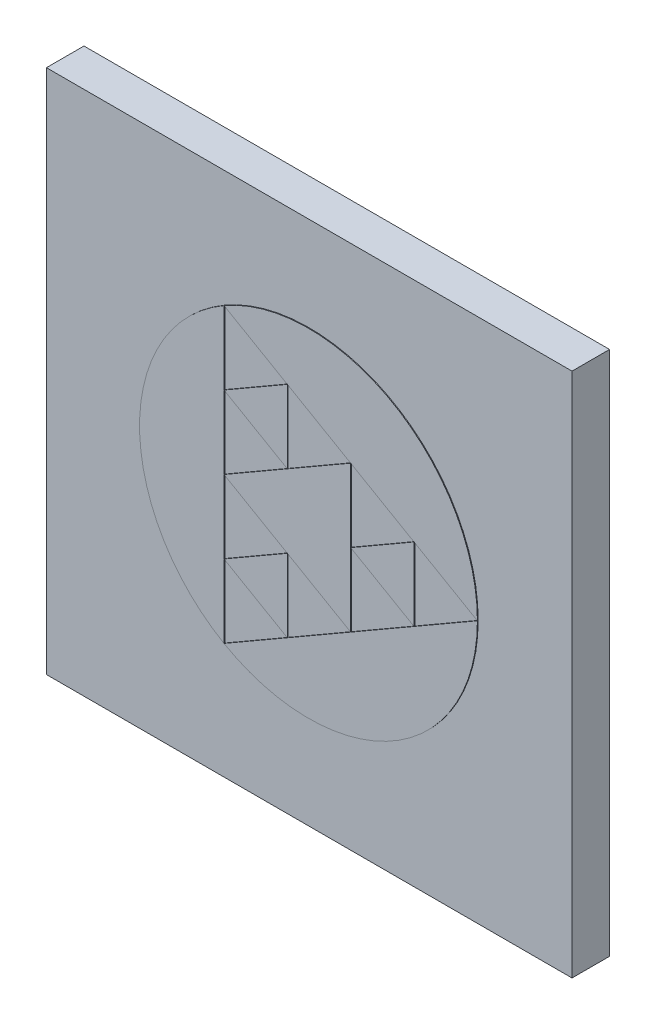
ISO-10303-21;
HEADER;
FILE_DESCRIPTION(('STEP AP214'),'2;1');
FILE_NAME('part.step','',(''),(''),'','','');
FILE_SCHEMA(('AUTOMOTIVE_DESIGN { 1 0 10303 214 1 1 1 1 }'));
ENDSEC;
DATA;
#1=APPLICATION_CONTEXT('core data for automotive mechanical design processes');
#2=APPLICATION_PROTOCOL_DEFINITION('international standard','automotive_design',2000,#1);
#3=PRODUCT_CONTEXT('',#1,'mechanical');
#4=PRODUCT('Part','Part','',(#3));
#5=PRODUCT_RELATED_PRODUCT_CATEGORY('part','',(#4));
#6=PRODUCT_DEFINITION_FORMATION('','',#4);
#7=PRODUCT_DEFINITION_CONTEXT('part definition',#1,'design');
#8=PRODUCT_DEFINITION('design','',#6,#7);
#9=PRODUCT_DEFINITION_SHAPE('','',#8);
#10=(LENGTH_UNIT() NAMED_UNIT(*) SI_UNIT(.MILLI.,.METRE.));
#11=(NAMED_UNIT(*) PLANE_ANGLE_UNIT() SI_UNIT($,.RADIAN.));
#12=(NAMED_UNIT(*) SI_UNIT($,.STERADIAN.) SOLID_ANGLE_UNIT());
#13=UNCERTAINTY_MEASURE_WITH_UNIT(LENGTH_MEASURE(1.E-05),#10,'distance_accuracy_value','');
#14=(GEOMETRIC_REPRESENTATION_CONTEXT(3) GLOBAL_UNCERTAINTY_ASSIGNED_CONTEXT((#13)) GLOBAL_UNIT_ASSIGNED_CONTEXT((#10,
#11,#12)) REPRESENTATION_CONTEXT('',''));
#15=CARTESIAN_POINT('',(0.,0.,0.));
#16=DIRECTION('',(0.,0.,1.));
#17=DIRECTION('',(1.,0.,0.));
#18=AXIS2_PLACEMENT_3D('',#15,#16,#17);
#19=CARTESIAN_POINT('',(0.,-7.84142135623731,0.5));
#20=DIRECTION('',(0.,0.,1.));
#21=DIRECTION('',(1.,0.,0.));
#22=AXIS2_PLACEMENT_3D('',#19,#20,#21);
#23=PLANE('',#22);
#24=DIRECTION('',(0.866025403784439,0.5,0.));
#25=VECTOR('',#24,1.);
#26=CARTESIAN_POINT('',(-3.25481004813967,-2.2039249838737,0.5));
#27=LINE('',#26,#25);
#28=CARTESIAN_POINT('',(0.562500000000003,0.,0.5));
#29=VERTEX_POINT('',#28);
#30=CARTESIAN_POINT('',(1.40625,0.487139289628746,0.5));
#31=VERTEX_POINT('',#30);
#32=EDGE_CURVE('P0_E59',#29,#31,#27,.T.);
#33=ORIENTED_EDGE('',*,*,#32,.T.);
#34=DIRECTION('',(0.,-1.,0.));
#35=VECTOR('',#34,1.);
#36=CARTESIAN_POINT('',(1.40625,-7.84142135623731,0.5));
#37=LINE('',#36,#35);
#38=CARTESIAN_POINT('',(1.40625,-0.487139289628749,0.5));
#39=VERTEX_POINT('',#38);
#40=EDGE_CURVE('P0_E48',#31,#39,#37,.T.);
#41=ORIENTED_EDGE('',*,*,#40,.T.);
#42=DIRECTION('',(-0.866025403784439,0.5,0.));
#43=VECTOR('',#42,1.);
#44=CARTESIAN_POINT('',(3.53606004813967,-1.71678569424496,0.5));
#45=LINE('',#44,#43);
#46=EDGE_CURVE('P0_E20',#39,#29,#45,.T.);
#47=ORIENTED_EDGE('',*,*,#46,.T.);
#48=EDGE_LOOP('',(#33,#41,#47));
#49=FACE_BOUND('',#48,.T.);
#50=ADVANCED_FACE('P0_F17',(#49),#23,.F.);
#51=CARTESIAN_POINT('',(3.53606004813967,-1.71678569424496,0.51));
#52=DIRECTION('',(0.5,0.866025403784439,0.));
#53=DIRECTION('',(-0.866025403784439,0.5,0.));
#54=AXIS2_PLACEMENT_3D('',#51,#52,#53);
#55=PLANE('',#54);
#56=DIRECTION('',(0.,0.,1.));
#57=VECTOR('',#56,1.);
#58=CARTESIAN_POINT('',(1.40625,-0.487139289628749,0.51));
#59=LINE('',#58,#57);
#60=CARTESIAN_POINT('',(1.40625,-0.487139289628749,0.51));
#61=VERTEX_POINT('',#60);
#62=EDGE_CURVE('P0_E54',#39,#61,#59,.T.);
#63=ORIENTED_EDGE('',*,*,#62,.T.);
#64=DIRECTION('',(0.866025403784434,-0.500000000000008,0.));
#65=VECTOR('',#64,1.);
#66=CARTESIAN_POINT('',(0.562500000000004,0.,0.51));
#67=LINE('',#66,#65);
#68=CARTESIAN_POINT('',(0.562500000000003,0.,0.51));
#69=VERTEX_POINT('',#68);
#70=EDGE_CURVE('P0_E68',#69,#61,#67,.T.);
#71=ORIENTED_EDGE('',*,*,#70,.F.);
#72=DIRECTION('',(0.,0.,1.));
#73=VECTOR('',#72,1.);
#74=CARTESIAN_POINT('',(0.562500000000005,0.,0.51));
#75=LINE('',#74,#73);
#76=EDGE_CURVE('P0_E56',#69,#29,#75,.F.);
#77=ORIENTED_EDGE('',*,*,#76,.T.);
#78=ORIENTED_EDGE('',*,*,#46,.F.);
#79=EDGE_LOOP('',(#63,#71,#77,#78));
#80=FACE_BOUND('',#79,.T.);
#81=ADVANCED_FACE('P0_F53',(#80),#55,.F.);
#82=CARTESIAN_POINT('',(1.40625,-7.84142135623731,0.51));
#83=DIRECTION('',(-1.,0.,0.));
#84=DIRECTION('',(0.,-1.,0.));
#85=AXIS2_PLACEMENT_3D('',#82,#83,#84);
#86=PLANE('',#85);
#87=DIRECTION('',(0.,0.,1.));
#88=VECTOR('',#87,1.);
#89=CARTESIAN_POINT('',(1.40625,0.487139289628747,0.51));
#90=LINE('',#89,#88);
#91=CARTESIAN_POINT('',(1.40625,0.487139289628747,0.51));
#92=VERTEX_POINT('',#91);
#93=EDGE_CURVE('P0_E35',#31,#92,#90,.T.);
#94=ORIENTED_EDGE('',*,*,#93,.T.);
#95=DIRECTION('',(0.,1.,0.));
#96=VECTOR('',#95,1.);
#97=CARTESIAN_POINT('',(1.40625,-7.84142135623731,0.51));
#98=LINE('',#97,#96);
#99=EDGE_CURVE('P0_E26',#61,#92,#98,.T.);
#100=ORIENTED_EDGE('',*,*,#99,.F.);
#101=ORIENTED_EDGE('',*,*,#62,.F.);
#102=ORIENTED_EDGE('',*,*,#40,.F.);
#103=EDGE_LOOP('',(#94,#100,#101,#102));
#104=FACE_BOUND('',#103,.T.);
#105=ADVANCED_FACE('P0_F61',(#104),#86,.F.);
#106=CARTESIAN_POINT('',(-3.25481004813967,-2.2039249838737,0.51));
#107=DIRECTION('',(0.5,-0.866025403784439,0.));
#108=DIRECTION('',(0.866025403784439,0.5,0.));
#109=AXIS2_PLACEMENT_3D('',#106,#107,#108);
#110=PLANE('',#109);
#111=ORIENTED_EDGE('',*,*,#76,.F.);
#112=DIRECTION('',(-0.866025403784439,-0.5,0.));
#113=VECTOR('',#112,1.);
#114=CARTESIAN_POINT('',(1.40625,0.487139289628746,0.51));
#115=LINE('',#114,#113);
#116=EDGE_CURVE('P0_E11',#92,#69,#115,.T.);
#117=ORIENTED_EDGE('',*,*,#116,.F.);
#118=ORIENTED_EDGE('',*,*,#93,.F.);
#119=ORIENTED_EDGE('',*,*,#32,.F.);
#120=EDGE_LOOP('',(#111,#117,#118,#119));
#121=FACE_BOUND('',#120,.T.);
#122=ADVANCED_FACE('P0_F73',(#121),#110,.F.);
#123=CARTESIAN_POINT('',(0.,-7.84142135623731,0.51));
#124=DIRECTION('',(0.,0.,1.));
#125=DIRECTION('',(1.,0.,0.));
#126=AXIS2_PLACEMENT_3D('',#123,#124,#125);
#127=PLANE('',#126);
#128=ORIENTED_EDGE('',*,*,#99,.T.);
#129=ORIENTED_EDGE('',*,*,#116,.T.);
#130=ORIENTED_EDGE('',*,*,#70,.T.);
#131=EDGE_LOOP('',(#128,#129,#130));
#132=FACE_BOUND('',#131,.T.);
#133=ADVANCED_FACE('P0_F71',(#132),#127,.T.);
#134=CLOSED_SHELL('',(#50,#81,#105,#122,#133));
#135=MANIFOLD_SOLID_BREP('P0_B1',#134);
#136=CARTESIAN_POINT('',(-3.5,-3.5,0.));
#137=DIRECTION('',(0.,0.,1.));
#138=DIRECTION('',(1.,0.,0.));
#139=AXIS2_PLACEMENT_3D('',#136,#137,#138);
#140=PLANE('',#139);
#141=DIRECTION('',(1.,0.,0.));
#142=VECTOR('',#141,1.);
#143=CARTESIAN_POINT('',(-3.5,3.5,0.));
#144=LINE('',#143,#142);
#145=CARTESIAN_POINT('',(-3.5,3.5,0.));
#146=VERTEX_POINT('',#145);
#147=CARTESIAN_POINT('',(3.5,3.5,0.));
#148=VERTEX_POINT('',#147);
#149=EDGE_CURVE('P1_E81',#146,#148,#144,.T.);
#150=ORIENTED_EDGE('',*,*,#149,.T.);
#151=DIRECTION('',(0.,-1.,0.));
#152=VECTOR('',#151,1.);
#153=CARTESIAN_POINT('',(3.5,3.5,0.));
#154=LINE('',#153,#152);
#155=CARTESIAN_POINT('',(3.5,-3.5,0.));
#156=VERTEX_POINT('',#155);
#157=EDGE_CURVE('P1_E68',#148,#156,#154,.T.);
#158=ORIENTED_EDGE('',*,*,#157,.T.);
#159=DIRECTION('',(1.,0.,0.));
#160=VECTOR('',#159,1.);
#161=CARTESIAN_POINT('',(-3.5,-3.5,0.));
#162=LINE('',#161,#160);
#163=CARTESIAN_POINT('',(-3.5,-3.5,0.));
#164=VERTEX_POINT('',#163);
#165=EDGE_CURVE('P1_E55',#156,#164,#162,.F.);
#166=ORIENTED_EDGE('',*,*,#165,.T.);
#167=DIRECTION('',(0.,1.,0.));
#168=VECTOR('',#167,1.);
#169=CARTESIAN_POINT('',(-3.5,3.5,0.));
#170=LINE('',#169,#168);
#171=EDGE_CURVE('P1_E20',#164,#146,#170,.T.);
#172=ORIENTED_EDGE('',*,*,#171,.T.);
#173=EDGE_LOOP('',(#150,#158,#166,#172));
#174=FACE_BOUND('',#173,.T.);
#175=ADVANCED_FACE('P1_F17',(#174),#140,.F.);
#176=CARTESIAN_POINT('',(-3.5,3.5,0.5));
#177=DIRECTION('',(1.,0.,0.));
#178=DIRECTION('',(0.,0.,-1.));
#179=AXIS2_PLACEMENT_3D('',#176,#177,#178);
#180=PLANE('',#179);
#181=DIRECTION('',(0.,0.,1.));
#182=VECTOR('',#181,1.);
#183=CARTESIAN_POINT('',(-3.5,-3.5,0.5));
#184=LINE('',#183,#182);
#185=CARTESIAN_POINT('',(-3.5,-3.5,0.5));
#186=VERTEX_POINT('',#185);
#187=EDGE_CURVE('P1_E61',#164,#186,#184,.T.);
#188=ORIENTED_EDGE('',*,*,#187,.T.);
#189=DIRECTION('',(0.,1.,0.));
#190=VECTOR('',#189,1.);
#191=CARTESIAN_POINT('',(-3.5,-3.5,0.5));
#192=LINE('',#191,#190);
#193=CARTESIAN_POINT('',(-3.5,3.5,0.5));
#194=VERTEX_POINT('',#193);
#195=EDGE_CURVE('P1_E83',#194,#186,#192,.F.);
#196=ORIENTED_EDGE('',*,*,#195,.F.);
#197=DIRECTION('',(0.,0.,-1.));
#198=VECTOR('',#197,1.);
#199=CARTESIAN_POINT('',(-3.5,3.5,0.5));
#200=LINE('',#199,#198);
#201=EDGE_CURVE('P1_E64',#194,#146,#200,.T.);
#202=ORIENTED_EDGE('',*,*,#201,.T.);
#203=ORIENTED_EDGE('',*,*,#171,.F.);
#204=EDGE_LOOP('',(#188,#196,#202,#203));
#205=FACE_BOUND('',#204,.T.);
#206=ADVANCED_FACE('P1_F60',(#205),#180,.F.);
#207=CARTESIAN_POINT('',(-3.5,-3.5,0.5));
#208=DIRECTION('',(0.,1.,0.));
#209=DIRECTION('',(0.,0.,1.));
#210=AXIS2_PLACEMENT_3D('',#207,#208,#209);
#211=PLANE('',#210);
#212=DIRECTION('',(0.,0.,1.));
#213=VECTOR('',#212,1.);
#214=CARTESIAN_POINT('',(3.5,-3.5,0.5));
#215=LINE('',#214,#213);
#216=CARTESIAN_POINT('',(3.5,-3.5,0.5));
#217=VERTEX_POINT('',#216);
#218=EDGE_CURVE('P1_E70',#156,#217,#215,.T.);
#219=ORIENTED_EDGE('',*,*,#218,.T.);
#220=DIRECTION('',(1.,0.,0.));
#221=VECTOR('',#220,1.);
#222=CARTESIAN_POINT('',(-3.5,-3.5,0.5));
#223=LINE('',#222,#221);
#224=EDGE_CURVE('P1_E74',#186,#217,#223,.T.);
#225=ORIENTED_EDGE('',*,*,#224,.F.);
#226=ORIENTED_EDGE('',*,*,#187,.F.);
#227=ORIENTED_EDGE('',*,*,#165,.F.);
#228=EDGE_LOOP('',(#219,#225,#226,#227));
#229=FACE_BOUND('',#228,.T.);
#230=ADVANCED_FACE('P1_F72',(#229),#211,.F.);
#231=CARTESIAN_POINT('',(3.5,3.5,0.5));
#232=DIRECTION('',(-1.,0.,0.));
#233=DIRECTION('',(0.,-1.,0.));
#234=AXIS2_PLACEMENT_3D('',#231,#232,#233);
#235=PLANE('',#234);
#236=DIRECTION('',(0.,0.,-1.));
#237=VECTOR('',#236,1.);
#238=CARTESIAN_POINT('',(3.5,3.5,0.5));
#239=LINE('',#238,#237);
#240=CARTESIAN_POINT('',(3.5,3.5,0.5));
#241=VERTEX_POINT('',#240);
#242=EDGE_CURVE('P1_E35',#148,#241,#239,.F.);
#243=ORIENTED_EDGE('',*,*,#242,.T.);
#244=DIRECTION('',(0.,1.,0.));
#245=VECTOR('',#244,1.);
#246=CARTESIAN_POINT('',(3.5,-3.5,0.5));
#247=LINE('',#246,#245);
#248=EDGE_CURVE('P1_E26',#217,#241,#247,.T.);
#249=ORIENTED_EDGE('',*,*,#248,.F.);
#250=ORIENTED_EDGE('',*,*,#218,.F.);
#251=ORIENTED_EDGE('',*,*,#157,.F.);
#252=EDGE_LOOP('',(#243,#249,#250,#251));
#253=FACE_BOUND('',#252,.T.);
#254=ADVANCED_FACE('P1_F89',(#253),#235,.F.);
#255=CARTESIAN_POINT('',(-3.5,3.5,0.5));
#256=DIRECTION('',(0.,-1.,0.));
#257=DIRECTION('',(0.,0.,-1.));
#258=AXIS2_PLACEMENT_3D('',#255,#256,#257);
#259=PLANE('',#258);
#260=ORIENTED_EDGE('',*,*,#201,.F.);
#261=DIRECTION('',(1.,0.,0.));
#262=VECTOR('',#261,1.);
#263=CARTESIAN_POINT('',(-3.5,3.5,0.5));
#264=LINE('',#263,#262);
#265=EDGE_CURVE('P1_E11',#241,#194,#264,.F.);
#266=ORIENTED_EDGE('',*,*,#265,.F.);
#267=ORIENTED_EDGE('',*,*,#242,.F.);
#268=ORIENTED_EDGE('',*,*,#149,.F.);
#269=EDGE_LOOP('',(#260,#266,#267,#268));
#270=FACE_BOUND('',#269,.T.);
#271=ADVANCED_FACE('P1_F91',(#270),#259,.F.);
#272=CARTESIAN_POINT('',(-3.5,-3.5,0.5));
#273=DIRECTION('',(0.,0.,1.));
#274=DIRECTION('',(1.,0.,0.));
#275=AXIS2_PLACEMENT_3D('',#272,#273,#274);
#276=PLANE('',#275);
#277=ORIENTED_EDGE('',*,*,#248,.T.);
#278=ORIENTED_EDGE('',*,*,#265,.T.);
#279=ORIENTED_EDGE('',*,*,#195,.T.);
#280=ORIENTED_EDGE('',*,*,#224,.T.);
#281=EDGE_LOOP('',(#277,#278,#279,#280));
#282=FACE_BOUND('',#281,.T.);
#283=ADVANCED_FACE('P1_F88',(#282),#276,.T.);
#284=CLOSED_SHELL('',(#175,#206,#230,#254,#271,#283));
#285=MANIFOLD_SOLID_BREP('P1_B1',#284);
#286=CARTESIAN_POINT('',(0.,-7.84142135623731,0.5));
#287=DIRECTION('',(0.,0.,1.));
#288=DIRECTION('',(1.,0.,0.));
#289=AXIS2_PLACEMENT_3D('',#286,#287,#288);
#290=PLANE('',#289);
#291=DIRECTION('',(0.866025403784439,0.5,0.));
#292=VECTOR('',#291,1.);
#293=CARTESIAN_POINT('',(-4.09856004813967,-0.742507114987457,0.5));
#294=LINE('',#293,#292);
#295=CARTESIAN_POINT('',(-1.125,0.974278579257495,0.5));
#296=VERTEX_POINT('',#295);
#297=CARTESIAN_POINT('',(-0.281250000000001,1.46141786888624,0.5));
#298=VERTEX_POINT('',#297);
#299=EDGE_CURVE('P2_E60',#296,#298,#294,.T.);
#300=ORIENTED_EDGE('',*,*,#299,.T.);
#301=DIRECTION('',(0.,-1.,0.));
#302=VECTOR('',#301,1.);
#303=CARTESIAN_POINT('',(-0.281250000000002,-7.84142135623731,0.5));
#304=LINE('',#303,#302);
#305=CARTESIAN_POINT('',(-0.281249999999998,0.487139289628746,0.5));
#306=VERTEX_POINT('',#305);
#307=EDGE_CURVE('P2_E49',#298,#306,#304,.T.);
#308=ORIENTED_EDGE('',*,*,#307,.T.);
#309=DIRECTION('',(-0.866025403784439,0.5,0.));
#310=VECTOR('',#309,1.);
#311=CARTESIAN_POINT('',(3.53606004813967,-1.71678569424496,0.5));
#312=LINE('',#311,#310);
#313=EDGE_CURVE('P2_E21',#306,#296,#312,.T.);
#314=ORIENTED_EDGE('',*,*,#313,.T.);
#315=EDGE_LOOP('',(#300,#308,#314));
#316=FACE_BOUND('',#315,.T.);
#317=ADVANCED_FACE('P2_F18',(#316),#290,.F.);
#318=CARTESIAN_POINT('',(3.53606004813967,-1.71678569424496,0.51));
#319=DIRECTION('',(0.5,0.866025403784439,0.));
#320=DIRECTION('',(-0.866025403784439,0.5,0.));
#321=AXIS2_PLACEMENT_3D('',#318,#319,#320);
#322=PLANE('',#321);
#323=DIRECTION('',(0.,0.,1.));
#324=VECTOR('',#323,1.);
#325=CARTESIAN_POINT('',(-0.28125,0.487139289628746,0.51));
#326=LINE('',#325,#324);
#327=CARTESIAN_POINT('',(-0.281249999999997,0.487139289628745,0.51));
#328=VERTEX_POINT('',#327);
#329=EDGE_CURVE('P2_E55',#306,#328,#326,.T.);
#330=ORIENTED_EDGE('',*,*,#329,.T.);
#331=DIRECTION('',(0.86602540378444,-0.499999999999998,0.));
#332=VECTOR('',#331,1.);
#333=CARTESIAN_POINT('',(-1.125,0.974278579257493,0.51));
#334=LINE('',#333,#332);
#335=CARTESIAN_POINT('',(-1.125,0.974278579257495,0.51));
#336=VERTEX_POINT('',#335);
#337=EDGE_CURVE('P2_E69',#336,#328,#334,.T.);
#338=ORIENTED_EDGE('',*,*,#337,.F.);
#339=DIRECTION('',(0.,0.,1.));
#340=VECTOR('',#339,1.);
#341=CARTESIAN_POINT('',(-1.125,0.974278579257495,0.51));
#342=LINE('',#341,#340);
#343=EDGE_CURVE('P2_E57',#336,#296,#342,.F.);
#344=ORIENTED_EDGE('',*,*,#343,.T.);
#345=ORIENTED_EDGE('',*,*,#313,.F.);
#346=EDGE_LOOP('',(#330,#338,#344,#345));
#347=FACE_BOUND('',#346,.T.);
#348=ADVANCED_FACE('P2_F54',(#347),#322,.F.);
#349=CARTESIAN_POINT('',(-0.281250000000002,-7.84142135623731,0.51));
#350=DIRECTION('',(-1.,0.,0.));
#351=DIRECTION('',(0.,-1.,0.));
#352=AXIS2_PLACEMENT_3D('',#349,#350,#351);
#353=PLANE('',#352);
#354=DIRECTION('',(0.,0.,1.));
#355=VECTOR('',#354,1.);
#356=CARTESIAN_POINT('',(-0.281250000000007,1.46141786888624,0.51));
#357=LINE('',#356,#355);
#358=CARTESIAN_POINT('',(-0.281250000000001,1.46141786888624,0.51));
#359=VERTEX_POINT('',#358);
#360=EDGE_CURVE('P2_E36',#298,#359,#357,.T.);
#361=ORIENTED_EDGE('',*,*,#360,.T.);
#362=DIRECTION('',(0.,1.,0.));
#363=VECTOR('',#362,1.);
#364=CARTESIAN_POINT('',(-0.281249999999997,-7.84142135623731,0.51));
#365=LINE('',#364,#363);
#366=EDGE_CURVE('P2_E27',#328,#359,#365,.T.);
#367=ORIENTED_EDGE('',*,*,#366,.F.);
#368=ORIENTED_EDGE('',*,*,#329,.F.);
#369=ORIENTED_EDGE('',*,*,#307,.F.);
#370=EDGE_LOOP('',(#361,#367,#368,#369));
#371=FACE_BOUND('',#370,.T.);
#372=ADVANCED_FACE('P2_F62',(#371),#353,.F.);
#373=CARTESIAN_POINT('',(-4.09856004813967,-0.742507114987457,0.51));
#374=DIRECTION('',(0.5,-0.866025403784439,0.));
#375=DIRECTION('',(0.866025403784439,0.5,0.));
#376=AXIS2_PLACEMENT_3D('',#373,#374,#375);
#377=PLANE('',#376);
#378=ORIENTED_EDGE('',*,*,#343,.F.);
#379=DIRECTION('',(-0.866025403784439,-0.5,0.));
#380=VECTOR('',#379,1.);
#381=CARTESIAN_POINT('',(-0.281250000000006,1.46141786888624,0.51));
#382=LINE('',#381,#380);
#383=EDGE_CURVE('P2_E11',#359,#336,#382,.T.);
#384=ORIENTED_EDGE('',*,*,#383,.F.);
#385=ORIENTED_EDGE('',*,*,#360,.F.);
#386=ORIENTED_EDGE('',*,*,#299,.F.);
#387=EDGE_LOOP('',(#378,#384,#385,#386));
#388=FACE_BOUND('',#387,.T.);
#389=ADVANCED_FACE('P2_F74',(#388),#377,.F.);
#390=CARTESIAN_POINT('',(0.,-7.84142135623731,0.51));
#391=DIRECTION('',(0.,0.,1.));
#392=DIRECTION('',(1.,0.,0.));
#393=AXIS2_PLACEMENT_3D('',#390,#391,#392);
#394=PLANE('',#393);
#395=ORIENTED_EDGE('',*,*,#366,.T.);
#396=ORIENTED_EDGE('',*,*,#383,.T.);
#397=ORIENTED_EDGE('',*,*,#337,.T.);
#398=EDGE_LOOP('',(#395,#396,#397));
#399=FACE_BOUND('',#398,.T.);
#400=ADVANCED_FACE('P2_F72',(#399),#394,.T.);
#401=CLOSED_SHELL('',(#317,#348,#372,#389,#400));
#402=MANIFOLD_SOLID_BREP('P2_B1',#401);
#403=CARTESIAN_POINT('',(0.,-7.84142135623731,0.5));
#404=DIRECTION('',(0.,0.,1.));
#405=DIRECTION('',(1.,0.,0.));
#406=AXIS2_PLACEMENT_3D('',#403,#404,#405);
#407=PLANE('',#406);
#408=DIRECTION('',(-0.866025403784443,0.499999999999992,0.));
#409=VECTOR('',#408,1.);
#410=CARTESIAN_POINT('',(3.11418504813964,-2.44749462868801,0.5));
#411=LINE('',#410,#409);
#412=CARTESIAN_POINT('',(0.562500000000019,-0.974278579257491,0.5));
#413=VERTEX_POINT('',#412);
#414=CARTESIAN_POINT('',(-1.125,0.,0.5));
#415=VERTEX_POINT('',#414);
#416=EDGE_CURVE('P3_E19',#413,#415,#411,.T.);
#417=ORIENTED_EDGE('',*,*,#416,.T.);
#418=DIRECTION('',(0.866025403784436,0.500000000000004,0.));
#419=VECTOR('',#418,1.);
#420=CARTESIAN_POINT('',(-3.67668504813968,-1.47321604943061,0.5));
#421=LINE('',#420,#419);
#422=CARTESIAN_POINT('',(0.56250000000001,0.974278579257495,0.5));
#423=VERTEX_POINT('',#422);
#424=EDGE_CURVE('P3_E52',#415,#423,#421,.T.);
#425=ORIENTED_EDGE('',*,*,#424,.T.);
#426=DIRECTION('',(0.,-1.,0.));
#427=VECTOR('',#426,1.);
#428=CARTESIAN_POINT('',(0.562500000000041,-7.84142135623731,0.5));
#429=LINE('',#428,#427);
#430=EDGE_CURVE('P3_E50',#423,#413,#429,.T.);
#431=ORIENTED_EDGE('',*,*,#430,.T.);
#432=EDGE_LOOP('',(#417,#425,#431));
#433=FACE_BOUND('',#432,.T.);
#434=ADVANCED_FACE('P3_F16',(#433),#407,.F.);
#435=CARTESIAN_POINT('',(3.11418504813964,-2.44749462868801,0.51));
#436=DIRECTION('',(0.499999999999992,0.866025403784443,0.));
#437=DIRECTION('',(-0.866025403784443,0.499999999999992,0.));
#438=AXIS2_PLACEMENT_3D('',#435,#436,#437);
#439=PLANE('',#438);
#440=DIRECTION('',(0.,0.,1.));
#441=VECTOR('',#440,1.);
#442=CARTESIAN_POINT('',(-1.125,0.,0.51));
#443=LINE('',#442,#441);
#444=CARTESIAN_POINT('',(-1.125,0.,0.51));
#445=VERTEX_POINT('',#444);
#446=EDGE_CURVE('P3_E58',#445,#415,#443,.F.);
#447=ORIENTED_EDGE('',*,*,#446,.T.);
#448=ORIENTED_EDGE('',*,*,#416,.F.);
#449=DIRECTION('',(0.,0.,1.));
#450=VECTOR('',#449,1.);
#451=CARTESIAN_POINT('',(0.562500000000009,-0.974278579257491,0.51));
#452=LINE('',#451,#450);
#453=CARTESIAN_POINT('',(0.562500000000019,-0.974278579257491,0.51));
#454=VERTEX_POINT('',#453);
#455=EDGE_CURVE('P3_E54',#413,#454,#452,.T.);
#456=ORIENTED_EDGE('',*,*,#455,.T.);
#457=DIRECTION('',(0.866025403784443,-0.499999999999992,0.));
#458=VECTOR('',#457,1.);
#459=CARTESIAN_POINT('',(-1.12499999999999,0.,0.51));
#460=LINE('',#459,#458);
#461=EDGE_CURVE('P3_E67',#445,#454,#460,.T.);
#462=ORIENTED_EDGE('',*,*,#461,.F.);
#463=EDGE_LOOP('',(#447,#448,#456,#462));
#464=FACE_BOUND('',#463,.T.);
#465=ADVANCED_FACE('P3_F56',(#464),#439,.F.);
#466=CARTESIAN_POINT('',(0.562500000000041,-7.84142135623731,0.51));
#467=DIRECTION('',(-1.,0.,0.));
#468=DIRECTION('',(0.,-1.,0.));
#469=AXIS2_PLACEMENT_3D('',#466,#467,#468);
#470=PLANE('',#469);
#471=ORIENTED_EDGE('',*,*,#430,.F.);
#472=DIRECTION('',(0.,0.,1.));
#473=VECTOR('',#472,1.);
#474=CARTESIAN_POINT('',(0.562499999999997,0.974278579257493,0.51));
#475=LINE('',#474,#473);
#476=CARTESIAN_POINT('',(0.562500000000005,0.974278579257493,0.51));
#477=VERTEX_POINT('',#476);
#478=EDGE_CURVE('P3_E34',#423,#477,#475,.T.);
#479=ORIENTED_EDGE('',*,*,#478,.T.);
#480=DIRECTION('',(0.,1.,0.));
#481=VECTOR('',#480,1.);
#482=CARTESIAN_POINT('',(0.562500000000022,-7.84142135623731,0.51));
#483=LINE('',#482,#481);
#484=EDGE_CURVE('P3_E25',#454,#477,#483,.T.);
#485=ORIENTED_EDGE('',*,*,#484,.F.);
#486=ORIENTED_EDGE('',*,*,#455,.F.);
#487=EDGE_LOOP('',(#471,#479,#485,#486));
#488=FACE_BOUND('',#487,.T.);
#489=ADVANCED_FACE('P3_F59',(#488),#470,.F.);
#490=CARTESIAN_POINT('',(-3.67668504813968,-1.47321604943061,0.51));
#491=DIRECTION('',(0.500000000000004,-0.866025403784436,0.));
#492=DIRECTION('',(0.866025403784436,0.500000000000004,0.));
#493=AXIS2_PLACEMENT_3D('',#490,#491,#492);
#494=PLANE('',#493);
#495=ORIENTED_EDGE('',*,*,#424,.F.);
#496=ORIENTED_EDGE('',*,*,#446,.F.);
#497=DIRECTION('',(-0.866025403784437,-0.500000000000002,0.));
#498=VECTOR('',#497,1.);
#499=CARTESIAN_POINT('',(0.5625,0.974278579257488,0.51));
#500=LINE('',#499,#498);
#501=EDGE_CURVE('P3_E10',#477,#445,#500,.T.);
#502=ORIENTED_EDGE('',*,*,#501,.F.);
#503=ORIENTED_EDGE('',*,*,#478,.F.);
#504=EDGE_LOOP('',(#495,#496,#502,#503));
#505=FACE_BOUND('',#504,.T.);
#506=ADVANCED_FACE('P3_F72',(#505),#494,.F.);
#507=CARTESIAN_POINT('',(0.,-7.84142135623731,0.51));
#508=DIRECTION('',(0.,0.,1.));
#509=DIRECTION('',(1.,0.,0.));
#510=AXIS2_PLACEMENT_3D('',#507,#508,#509);
#511=PLANE('',#510);
#512=ORIENTED_EDGE('',*,*,#484,.T.);
#513=ORIENTED_EDGE('',*,*,#501,.T.);
#514=ORIENTED_EDGE('',*,*,#461,.T.);
#515=EDGE_LOOP('',(#512,#513,#514));
#516=FACE_BOUND('',#515,.T.);
#517=ADVANCED_FACE('P3_F70',(#516),#511,.T.);
#518=CLOSED_SHELL('',(#434,#465,#489,#506,#517));
#519=MANIFOLD_SOLID_BREP('P3_B1',#518);
#520=CARTESIAN_POINT('',(0.,-7.84142135623731,0.5));
#521=DIRECTION('',(0.,0.,1.));
#522=DIRECTION('',(1.,0.,0.));
#523=AXIS2_PLACEMENT_3D('',#520,#521,#522);
#524=PLANE('',#523);
#525=DIRECTION('',(0.,1.,0.));
#526=VECTOR('',#525,1.);
#527=CARTESIAN_POINT('',(-1.12499999999994,-7.84142135623732,0.5));
#528=LINE('',#527,#526);
#529=CARTESIAN_POINT('',(-1.12499999999998,-1.948557158515,0.5));
#530=VERTEX_POINT('',#529);
#531=CARTESIAN_POINT('',(-1.12500000000001,1.94855715851498,0.5));
#532=VERTEX_POINT('',#531);
#533=EDGE_CURVE('P4_E41',#530,#532,#528,.T.);
#534=ORIENTED_EDGE('',*,*,#533,.F.);
#535=CARTESIAN_POINT('',(0.,0.,0.5));
#536=DIRECTION('',(0.,0.,-1.));
#537=DIRECTION('',(-1.,0.,0.));
#538=AXIS2_PLACEMENT_3D('',#535,#536,#537);
#539=CIRCLE('',#538,2.25);
#540=EDGE_CURVE('P4_E20',#532,#530,#539,.F.);
#541=ORIENTED_EDGE('',*,*,#540,.F.);
#542=EDGE_LOOP('',(#534,#541));
#543=FACE_BOUND('',#542,.T.);
#544=ADVANCED_FACE('P4_F17',(#543),#524,.F.);
#545=CARTESIAN_POINT('',(-1.12499999999994,-7.84142135623732,0.51));
#546=DIRECTION('',(1.,0.,0.));
#547=DIRECTION('',(0.,1.,0.));
#548=AXIS2_PLACEMENT_3D('',#545,#546,#547);
#549=PLANE('',#548);
#550=DIRECTION('',(0.,1.,0.));
#551=VECTOR('',#550,1.);
#552=CARTESIAN_POINT('',(-1.12499999999998,-7.84142135623731,0.51));
#553=LINE('',#552,#551);
#554=CARTESIAN_POINT('',(-1.12499999999998,-1.948557158515,0.51));
#555=VERTEX_POINT('',#554);
#556=CARTESIAN_POINT('',(-1.125,1.94855715851499,0.51));
#557=VERTEX_POINT('',#556);
#558=EDGE_CURVE('P4_E26',#555,#557,#553,.T.);
#559=ORIENTED_EDGE('',*,*,#558,.F.);
#560=DIRECTION('',(0.,0.,-1.));
#561=VECTOR('',#560,1.);
#562=CARTESIAN_POINT('',(-1.12499999999998,-1.948557158515,0.51));
#563=LINE('',#562,#561);
#564=EDGE_CURVE('P4_E46',#530,#555,#563,.F.);
#565=ORIENTED_EDGE('',*,*,#564,.F.);
#566=ORIENTED_EDGE('',*,*,#533,.T.);
#567=DIRECTION('',(0.,0.,-1.));
#568=VECTOR('',#567,1.);
#569=CARTESIAN_POINT('',(-1.12500000000001,1.94855715851498,0.51));
#570=LINE('',#569,#568);
#571=EDGE_CURVE('P4_E34',#557,#532,#570,.T.);
#572=ORIENTED_EDGE('',*,*,#571,.F.);
#573=EDGE_LOOP('',(#559,#565,#566,#572));
#574=FACE_BOUND('',#573,.T.);
#575=ADVANCED_FACE('P4_F47',(#574),#549,.T.);
#576=CARTESIAN_POINT('',(0.,0.,0.51));
#577=DIRECTION('',(0.,0.,-1.));
#578=DIRECTION('',(-1.,0.,0.));
#579=AXIS2_PLACEMENT_3D('',#576,#577,#578);
#580=CYLINDRICAL_SURFACE('',#579,2.25);
#581=ORIENTED_EDGE('',*,*,#540,.T.);
#582=ORIENTED_EDGE('',*,*,#564,.T.);
#583=CARTESIAN_POINT('',(0.,0.,0.51));
#584=DIRECTION('',(0.,0.,-1.));
#585=DIRECTION('',(-1.,0.,0.));
#586=AXIS2_PLACEMENT_3D('',#583,#584,#585);
#587=CIRCLE('',#586,2.25);
#588=EDGE_CURVE('P4_E11',#557,#555,#587,.F.);
#589=ORIENTED_EDGE('',*,*,#588,.F.);
#590=ORIENTED_EDGE('',*,*,#571,.T.);
#591=EDGE_LOOP('',(#581,#582,#589,#590));
#592=FACE_BOUND('',#591,.T.);
#593=ADVANCED_FACE('P4_F49',(#592),#580,.T.);
#594=CARTESIAN_POINT('',(0.,-7.84142135623731,0.51));
#595=DIRECTION('',(0.,0.,1.));
#596=DIRECTION('',(1.,0.,0.));
#597=AXIS2_PLACEMENT_3D('',#594,#595,#596);
#598=PLANE('',#597);
#599=ORIENTED_EDGE('',*,*,#588,.T.);
#600=ORIENTED_EDGE('',*,*,#558,.T.);
#601=EDGE_LOOP('',(#599,#600));
#602=FACE_BOUND('',#601,.T.);
#603=ADVANCED_FACE('P4_F55',(#602),#598,.T.);
#604=CLOSED_SHELL('',(#544,#575,#593,#603));
#605=MANIFOLD_SOLID_BREP('P4_B1',#604);
#606=CARTESIAN_POINT('',(0.,-7.84142135623731,0.5));
#607=DIRECTION('',(0.,0.,1.));
#608=DIRECTION('',(1.,0.,0.));
#609=AXIS2_PLACEMENT_3D('',#606,#607,#608);
#610=PLANE('',#609);
#611=DIRECTION('',(0.86602540378444,-0.499999999999998,0.));
#612=VECTOR('',#611,1.);
#613=CARTESIAN_POINT('',(3.95793504813966,-0.986076759801823,0.5));
#614=LINE('',#613,#612);
#615=CARTESIAN_POINT('',(-1.12500000000001,1.94855715851498,0.5));
#616=VERTEX_POINT('',#615);
#617=CARTESIAN_POINT('',(2.25,0.,0.5));
#618=VERTEX_POINT('',#617);
#619=EDGE_CURVE('P5_E42',#616,#618,#614,.T.);
#620=ORIENTED_EDGE('',*,*,#619,.F.);
#621=CARTESIAN_POINT('',(0.,0.,0.5));
#622=DIRECTION('',(0.,0.,-1.));
#623=DIRECTION('',(-1.,0.,0.));
#624=AXIS2_PLACEMENT_3D('',#621,#622,#623);
#625=CIRCLE('',#624,2.25);
#626=EDGE_CURVE('P5_E20',#618,#616,#625,.F.);
#627=ORIENTED_EDGE('',*,*,#626,.F.);
#628=EDGE_LOOP('',(#620,#627));
#629=FACE_BOUND('',#628,.T.);
#630=ADVANCED_FACE('P5_F17',(#629),#610,.F.);
#631=CARTESIAN_POINT('',(3.95793504813966,-0.986076759801823,0.51));
#632=DIRECTION('',(-0.499999999999998,-0.86602540378444,0.));
#633=DIRECTION('',(0.86602540378444,-0.499999999999998,0.));
#634=AXIS2_PLACEMENT_3D('',#631,#632,#633);
#635=PLANE('',#634);
#636=DIRECTION('',(0.86602540378444,-0.499999999999998,0.));
#637=VECTOR('',#636,1.);
#638=CARTESIAN_POINT('',(-1.12500000000001,1.94855715851498,0.51));
#639=LINE('',#638,#637);
#640=CARTESIAN_POINT('',(-1.12500000000001,1.94855715851498,0.51));
#641=VERTEX_POINT('',#640);
#642=CARTESIAN_POINT('',(2.25,0.,0.51));
#643=VERTEX_POINT('',#642);
#644=EDGE_CURVE('P5_E26',#641,#643,#639,.T.);
#645=ORIENTED_EDGE('',*,*,#644,.F.);
#646=DIRECTION('',(0.,0.,-1.));
#647=VECTOR('',#646,1.);
#648=CARTESIAN_POINT('',(-1.12500000000001,1.94855715851498,0.51));
#649=LINE('',#648,#647);
#650=EDGE_CURVE('P5_E46',#616,#641,#649,.F.);
#651=ORIENTED_EDGE('',*,*,#650,.F.);
#652=ORIENTED_EDGE('',*,*,#619,.T.);
#653=DIRECTION('',(0.,0.,-1.));
#654=VECTOR('',#653,1.);
#655=CARTESIAN_POINT('',(2.25,0.,0.51));
#656=LINE('',#655,#654);
#657=EDGE_CURVE('P5_E34',#643,#618,#656,.T.);
#658=ORIENTED_EDGE('',*,*,#657,.F.);
#659=EDGE_LOOP('',(#645,#651,#652,#658));
#660=FACE_BOUND('',#659,.T.);
#661=ADVANCED_FACE('P5_F47',(#660),#635,.T.);
#662=CARTESIAN_POINT('',(0.,0.,0.51));
#663=DIRECTION('',(0.,0.,-1.));
#664=DIRECTION('',(-1.,0.,0.));
#665=AXIS2_PLACEMENT_3D('',#662,#663,#664);
#666=CYLINDRICAL_SURFACE('',#665,2.25);
#667=CARTESIAN_POINT('',(0.,0.,0.51));
#668=DIRECTION('',(0.,0.,-1.));
#669=DIRECTION('',(-1.,0.,0.));
#670=AXIS2_PLACEMENT_3D('',#667,#668,#669);
#671=CIRCLE('',#670,2.25);
#672=EDGE_CURVE('P5_E11',#643,#641,#671,.F.);
#673=ORIENTED_EDGE('',*,*,#672,.F.);
#674=ORIENTED_EDGE('',*,*,#657,.T.);
#675=ORIENTED_EDGE('',*,*,#626,.T.);
#676=ORIENTED_EDGE('',*,*,#650,.T.);
#677=EDGE_LOOP('',(#673,#674,#675,#676));
#678=FACE_BOUND('',#677,.T.);
#679=ADVANCED_FACE('P5_F51',(#678),#666,.T.);
#680=CARTESIAN_POINT('',(0.,-7.84142135623731,0.51));
#681=DIRECTION('',(0.,0.,1.));
#682=DIRECTION('',(1.,0.,0.));
#683=AXIS2_PLACEMENT_3D('',#680,#681,#682);
#684=PLANE('',#683);
#685=ORIENTED_EDGE('',*,*,#644,.T.);
#686=ORIENTED_EDGE('',*,*,#672,.T.);
#687=EDGE_LOOP('',(#685,#686));
#688=FACE_BOUND('',#687,.T.);
#689=ADVANCED_FACE('P5_F55',(#688),#684,.T.);
#690=CLOSED_SHELL('',(#630,#661,#679,#689));
#691=MANIFOLD_SOLID_BREP('P5_B1',#690);
#692=CARTESIAN_POINT('',(0.,-7.84142135623731,0.5));
#693=DIRECTION('',(0.,0.,1.));
#694=DIRECTION('',(1.,0.,0.));
#695=AXIS2_PLACEMENT_3D('',#692,#693,#694);
#696=PLANE('',#695);
#697=CARTESIAN_POINT('',(0.,0.,0.5));
#698=DIRECTION('',(0.,0.,-1.));
#699=DIRECTION('',(-1.,0.,0.));
#700=AXIS2_PLACEMENT_3D('',#697,#698,#699);
#701=CIRCLE('',#700,2.25);
#702=CARTESIAN_POINT('',(-1.12499999999998,-1.948557158515,0.5));
#703=VERTEX_POINT('',#702);
#704=CARTESIAN_POINT('',(2.25,0.,0.5));
#705=VERTEX_POINT('',#704);
#706=EDGE_CURVE('P6_E20',#703,#705,#701,.F.);
#707=ORIENTED_EDGE('',*,*,#706,.F.);
#708=DIRECTION('',(-0.866025403784436,-0.500000000000004,0.));
#709=VECTOR('',#708,1.);
#710=CARTESIAN_POINT('',(-2.83293504813967,-2.93463391831686,0.5));
#711=LINE('',#710,#709);
#712=EDGE_CURVE('P6_E42',#705,#703,#711,.T.);
#713=ORIENTED_EDGE('',*,*,#712,.F.);
#714=EDGE_LOOP('',(#707,#713));
#715=FACE_BOUND('',#714,.T.);
#716=ADVANCED_FACE('P6_F17',(#715),#696,.F.);
#717=CARTESIAN_POINT('',(-2.83293504813967,-2.93463391831686,0.51));
#718=DIRECTION('',(-0.500000000000004,0.866025403784436,0.));
#719=DIRECTION('',(-0.866025403784436,-0.500000000000004,0.));
#720=AXIS2_PLACEMENT_3D('',#717,#718,#719);
#721=PLANE('',#720);
#722=DIRECTION('',(0.,0.,-1.));
#723=VECTOR('',#722,1.);
#724=CARTESIAN_POINT('',(-1.12499999999998,-1.948557158515,0.51));
#725=LINE('',#724,#723);
#726=CARTESIAN_POINT('',(-1.12499999999998,-1.948557158515,0.51));
#727=VERTEX_POINT('',#726);
#728=EDGE_CURVE('P6_E34',#727,#703,#725,.T.);
#729=ORIENTED_EDGE('',*,*,#728,.F.);
#730=DIRECTION('',(-0.866025403784436,-0.500000000000004,0.));
#731=VECTOR('',#730,1.);
#732=CARTESIAN_POINT('',(2.25,0.,0.51));
#733=LINE('',#732,#731);
#734=CARTESIAN_POINT('',(2.25,0.,0.51));
#735=VERTEX_POINT('',#734);
#736=EDGE_CURVE('P6_E26',#735,#727,#733,.T.);
#737=ORIENTED_EDGE('',*,*,#736,.F.);
#738=DIRECTION('',(0.,0.,-1.));
#739=VECTOR('',#738,1.);
#740=CARTESIAN_POINT('',(2.25,0.,0.51));
#741=LINE('',#740,#739);
#742=EDGE_CURVE('P6_E46',#705,#735,#741,.F.);
#743=ORIENTED_EDGE('',*,*,#742,.F.);
#744=ORIENTED_EDGE('',*,*,#712,.T.);
#745=EDGE_LOOP('',(#729,#737,#743,#744));
#746=FACE_BOUND('',#745,.T.);
#747=ADVANCED_FACE('P6_F47',(#746),#721,.T.);
#748=CARTESIAN_POINT('',(0.,0.,0.51));
#749=DIRECTION('',(0.,0.,-1.));
#750=DIRECTION('',(-1.,0.,0.));
#751=AXIS2_PLACEMENT_3D('',#748,#749,#750);
#752=CYLINDRICAL_SURFACE('',#751,2.25);
#753=CARTESIAN_POINT('',(0.,0.,0.51));
#754=DIRECTION('',(0.,0.,-1.));
#755=DIRECTION('',(-1.,0.,0.));
#756=AXIS2_PLACEMENT_3D('',#753,#754,#755);
#757=CIRCLE('',#756,2.25);
#758=EDGE_CURVE('P6_E11',#727,#735,#757,.F.);
#759=ORIENTED_EDGE('',*,*,#758,.F.);
#760=ORIENTED_EDGE('',*,*,#728,.T.);
#761=ORIENTED_EDGE('',*,*,#706,.T.);
#762=ORIENTED_EDGE('',*,*,#742,.T.);
#763=EDGE_LOOP('',(#759,#760,#761,#762));
#764=FACE_BOUND('',#763,.T.);
#765=ADVANCED_FACE('P6_F51',(#764),#752,.T.);
#766=CARTESIAN_POINT('',(0.,-7.84142135623731,0.51));
#767=DIRECTION('',(0.,0.,1.));
#768=DIRECTION('',(1.,0.,0.));
#769=AXIS2_PLACEMENT_3D('',#766,#767,#768);
#770=PLANE('',#769);
#771=ORIENTED_EDGE('',*,*,#736,.T.);
#772=ORIENTED_EDGE('',*,*,#758,.T.);
#773=EDGE_LOOP('',(#771,#772));
#774=FACE_BOUND('',#773,.T.);
#775=ADVANCED_FACE('P6_F55',(#774),#770,.T.);
#776=CLOSED_SHELL('',(#716,#747,#765,#775));
#777=MANIFOLD_SOLID_BREP('P6_B1',#776);
#778=CARTESIAN_POINT('',(0.,-7.84142135623731,0.51));
#779=DIRECTION('',(0.,0.,1.));
#780=DIRECTION('',(1.,0.,0.));
#781=AXIS2_PLACEMENT_3D('',#778,#779,#780);
#782=PLANE('',#781);
#783=DIRECTION('',(-0.866025403784438,0.5,0.));
#784=VECTOR('',#783,1.);
#785=CARTESIAN_POINT('',(2.69231004813967,-3.1782035631312,0.51));
#786=LINE('',#785,#784);
#787=CARTESIAN_POINT('',(-1.12499999999999,-0.974278579257498,0.51));
#788=VERTEX_POINT('',#787);
#789=CARTESIAN_POINT('',(-0.281249999999998,-1.46141786888625,0.51));
#790=VERTEX_POINT('',#789);
#791=EDGE_CURVE('P7_E20',#788,#790,#786,.F.);
#792=ORIENTED_EDGE('',*,*,#791,.T.);
#793=DIRECTION('',(0.,-1.,0.));
#794=VECTOR('',#793,1.);
#795=CARTESIAN_POINT('',(-0.28125000000001,-7.84142135623731,0.51));
#796=LINE('',#795,#794);
#797=CARTESIAN_POINT('',(-0.281249999999999,-0.487139289628743,0.51));
#798=VERTEX_POINT('',#797);
#799=EDGE_CURVE('P7_E50',#790,#798,#796,.F.);
#800=ORIENTED_EDGE('',*,*,#799,.T.);
#801=DIRECTION('',(0.866025403784438,0.500000000000001,0.));
#802=VECTOR('',#801,1.);
#803=CARTESIAN_POINT('',(-3.25481004813967,-2.2039249838737,0.51));
#804=LINE('',#803,#802);
#805=EDGE_CURVE('P7_E51',#798,#788,#804,.F.);
#806=ORIENTED_EDGE('',*,*,#805,.T.);
#807=EDGE_LOOP('',(#792,#800,#806));
#808=FACE_BOUND('',#807,.T.);
#809=ADVANCED_FACE('P7_F17',(#808),#782,.T.);
#810=CARTESIAN_POINT('',(2.69231004813967,-3.1782035631312,0.51));
#811=DIRECTION('',(0.5,0.866025403784438,0.));
#812=DIRECTION('',(-0.866025403784438,0.5,0.));
#813=AXIS2_PLACEMENT_3D('',#810,#811,#812);
#814=PLANE('',#813);
#815=DIRECTION('',(0.,0.,1.));
#816=VECTOR('',#815,1.);
#817=CARTESIAN_POINT('',(-0.281250000000001,-1.46141786888625,0.51));
#818=LINE('',#817,#816);
#819=CARTESIAN_POINT('',(-0.281249999999995,-1.46141786888625,0.5));
#820=VERTEX_POINT('',#819);
#821=EDGE_CURVE('P7_E56',#820,#790,#818,.T.);
#822=ORIENTED_EDGE('',*,*,#821,.T.);
#823=ORIENTED_EDGE('',*,*,#791,.F.);
#824=DIRECTION('',(0.,0.,1.));
#825=VECTOR('',#824,1.);
#826=CARTESIAN_POINT('',(-1.12499999999999,-0.974278579257491,0.51));
#827=LINE('',#826,#825);
#828=CARTESIAN_POINT('',(-1.12499999999999,-0.974278579257498,0.5));
#829=VERTEX_POINT('',#828);
#830=EDGE_CURVE('P7_E68',#788,#829,#827,.F.);
#831=ORIENTED_EDGE('',*,*,#830,.T.);
#832=DIRECTION('',(0.866025403784438,-0.5,0.));
#833=VECTOR('',#832,1.);
#834=CARTESIAN_POINT('',(-1.12499999999999,-0.974278579257502,0.5));
#835=LINE('',#834,#833);
#836=EDGE_CURVE('P7_E64',#829,#820,#835,.T.);
#837=ORIENTED_EDGE('',*,*,#836,.T.);
#838=EDGE_LOOP('',(#822,#823,#831,#837));
#839=FACE_BOUND('',#838,.T.);
#840=ADVANCED_FACE('P7_F63',(#839),#814,.F.);
#841=CARTESIAN_POINT('',(-0.28125000000001,-7.84142135623731,0.51));
#842=DIRECTION('',(-1.,0.,0.));
#843=DIRECTION('',(0.,-1.,0.));
#844=AXIS2_PLACEMENT_3D('',#841,#842,#843);
#845=PLANE('',#844);
#846=DIRECTION('',(0.,0.,1.));
#847=VECTOR('',#846,1.);
#848=CARTESIAN_POINT('',(-0.281249999999998,-0.487139289628745,0.51));
#849=LINE('',#848,#847);
#850=CARTESIAN_POINT('',(-0.281249999999996,-0.487139289628741,0.5));
#851=VERTEX_POINT('',#850);
#852=EDGE_CURVE('P7_E34',#851,#798,#849,.T.);
#853=ORIENTED_EDGE('',*,*,#852,.T.);
#854=ORIENTED_EDGE('',*,*,#799,.F.);
#855=ORIENTED_EDGE('',*,*,#821,.F.);
#856=DIRECTION('',(0.,1.,0.));
#857=VECTOR('',#856,1.);
#858=CARTESIAN_POINT('',(-0.281249999999988,-7.84142135623731,0.5));
#859=LINE('',#858,#857);
#860=EDGE_CURVE('P7_E26',#820,#851,#859,.T.);
#861=ORIENTED_EDGE('',*,*,#860,.T.);
#862=EDGE_LOOP('',(#853,#854,#855,#861));
#863=FACE_BOUND('',#862,.T.);
#864=ADVANCED_FACE('P7_F58',(#863),#845,.F.);
#865=CARTESIAN_POINT('',(-3.25481004813967,-2.2039249838737,0.51));
#866=DIRECTION('',(0.500000000000001,-0.866025403784438,0.));
#867=DIRECTION('',(0.866025403784438,0.500000000000001,0.));
#868=AXIS2_PLACEMENT_3D('',#865,#866,#867);
#869=PLANE('',#868);
#870=ORIENTED_EDGE('',*,*,#830,.F.);
#871=ORIENTED_EDGE('',*,*,#805,.F.);
#872=ORIENTED_EDGE('',*,*,#852,.F.);
#873=DIRECTION('',(-0.86602540378443,-0.500000000000015,0.));
#874=VECTOR('',#873,1.);
#875=CARTESIAN_POINT('',(-0.281249999999999,-0.487139289628742,0.5));
#876=LINE('',#875,#874);
#877=EDGE_CURVE('P7_E11',#851,#829,#876,.T.);
#878=ORIENTED_EDGE('',*,*,#877,.T.);
#879=EDGE_LOOP('',(#870,#871,#872,#878));
#880=FACE_BOUND('',#879,.T.);
#881=ADVANCED_FACE('P7_F73',(#880),#869,.F.);
#882=CARTESIAN_POINT('',(0.,-7.84142135623731,0.5));
#883=DIRECTION('',(0.,0.,1.));
#884=DIRECTION('',(1.,0.,0.));
#885=AXIS2_PLACEMENT_3D('',#882,#883,#884);
#886=PLANE('',#885);
#887=ORIENTED_EDGE('',*,*,#860,.F.);
#888=ORIENTED_EDGE('',*,*,#836,.F.);
#889=ORIENTED_EDGE('',*,*,#877,.F.);
#890=EDGE_LOOP('',(#887,#888,#889));
#891=FACE_BOUND('',#890,.T.);
#892=ADVANCED_FACE('P7_F72',(#891),#886,.F.);
#893=CLOSED_SHELL('',(#809,#840,#864,#881,#892));
#894=MANIFOLD_SOLID_BREP('P7_B1',#893);
#895=ADVANCED_BREP_SHAPE_REPRESENTATION('',(#18,#135,#285,#402,#519,#605,#691,#777,#894),#14);
#896=SHAPE_DEFINITION_REPRESENTATION(#9,#895);
ENDSEC;
END-ISO-10303-21;
